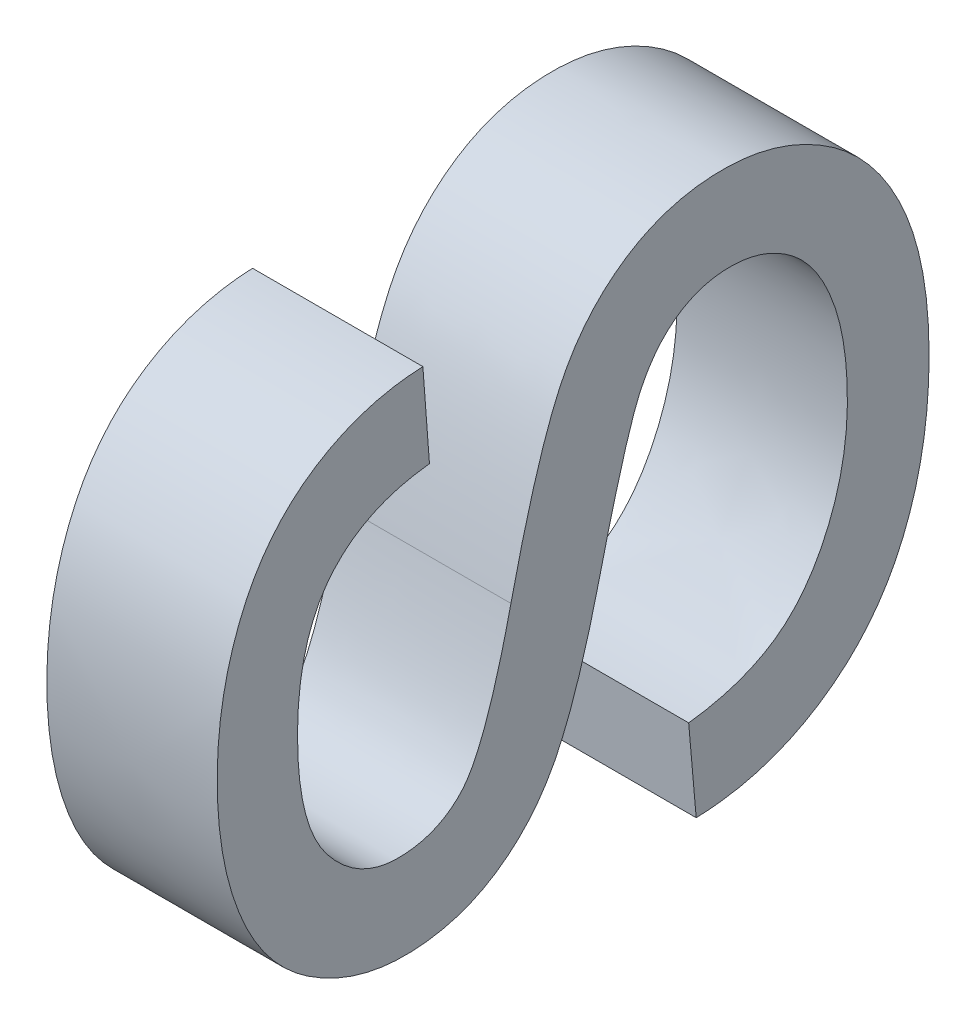
ISO-10303-21;
HEADER;
FILE_DESCRIPTION(('STEP AP214'),'2;1');
FILE_NAME('part.step','',(''),(''),'','','');
FILE_SCHEMA(('AUTOMOTIVE_DESIGN { 1 0 10303 214 1 1 1 1 }'));
ENDSEC;
DATA;
#1=APPLICATION_CONTEXT('core data for automotive mechanical design processes');
#2=APPLICATION_PROTOCOL_DEFINITION('international standard','automotive_design',2000,#1);
#3=PRODUCT_CONTEXT('',#1,'mechanical');
#4=PRODUCT('Part','Part','',(#3));
#5=PRODUCT_RELATED_PRODUCT_CATEGORY('part','',(#4));
#6=PRODUCT_DEFINITION_FORMATION('','',#4);
#7=PRODUCT_DEFINITION_CONTEXT('part definition',#1,'design');
#8=PRODUCT_DEFINITION('design','',#6,#7);
#9=PRODUCT_DEFINITION_SHAPE('','',#8);
#10=(LENGTH_UNIT() NAMED_UNIT(*) SI_UNIT(.MILLI.,.METRE.));
#11=(NAMED_UNIT(*) PLANE_ANGLE_UNIT() SI_UNIT($,.RADIAN.));
#12=(NAMED_UNIT(*) SI_UNIT($,.STERADIAN.) SOLID_ANGLE_UNIT());
#13=UNCERTAINTY_MEASURE_WITH_UNIT(LENGTH_MEASURE(1.E-05),#10,'distance_accuracy_value','');
#14=(GEOMETRIC_REPRESENTATION_CONTEXT(3) GLOBAL_UNCERTAINTY_ASSIGNED_CONTEXT((#13)) GLOBAL_UNIT_ASSIGNED_CONTEXT((#10,
#11,#12)) REPRESENTATION_CONTEXT('',''));
#15=CARTESIAN_POINT('',(0.,0.,0.));
#16=DIRECTION('',(0.,0.,1.));
#17=DIRECTION('',(1.,0.,0.));
#18=AXIS2_PLACEMENT_3D('',#15,#16,#17);
#19=CARTESIAN_POINT('',(4.55229940712933,-40.7604175531636,-9.25696894879945));
#20=DIRECTION('',(-1.,0.,0.));
#21=DIRECTION('',(0.,0.,1.));
#22=AXIS2_PLACEMENT_3D('',#19,#20,#21);
#23=PLANE('',#22);
#24=CARTESIAN_POINT('',(4.55229940712938,-41.1355313061002,-9.08233227842367));
#25=CARTESIAN_POINT('',(4.55229940712937,-41.1103090056195,-9.08012704996634));
#26=CARTESIAN_POINT('',(4.55229940712937,-41.0850867051389,-9.07792182150902));
#27=(BOUNDED_CURVE() B_SPLINE_CURVE(2,(#24,#25,#26),.UNSPECIFIED.,.F.,
.F.) B_SPLINE_CURVE_WITH_KNOTS((3,3),(50.,51.),
.UNSPECIFIED.) CURVE() GEOMETRIC_REPRESENTATION_ITEM() RATIONAL_B_SPLINE_CURVE((1.,1.,1.)) REPRESENTATION_ITEM(''));
#28=CARTESIAN_POINT('',(4.55229940712938,-41.1355313061002,-9.08233227842367));
#29=VERTEX_POINT('',#28);
#30=CARTESIAN_POINT('',(4.55229940712937,-41.0850867051389,-9.07792182150902));
#31=VERTEX_POINT('',#30);
#32=EDGE_CURVE('E20',#29,#31,#27,.T.);
#33=ORIENTED_EDGE('',*,*,#32,.T.);
#34=CARTESIAN_POINT('',(4.55229940712937,-41.0850867051389,-9.07792182150902));
#35=CARTESIAN_POINT('',(4.55229940712937,-41.0815032088957,-9.10824371279723));
#36=CARTESIAN_POINT('',(4.55229940712937,-41.055316120965,-9.14711086435757));
#37=CARTESIAN_POINT('',(4.55229940712936,-41.0001854095319,-9.17109272383097));
#38=CARTESIAN_POINT('',(4.55229940712935,-40.9351311700408,-9.17109272383097));
#39=CARTESIAN_POINT('',(4.55229940712934,-40.8882700653227,-9.15289958905805));
#40=CARTESIAN_POINT('',(4.55229940712934,-40.8653908200779,-9.12119942998401));
#41=CARTESIAN_POINT('',(4.55229940712934,-40.8653908200779,-9.08343489265233));
#42=CARTESIAN_POINT('',(4.55229940712934,-40.8874431046512,-9.05504257626428));
#43=CARTESIAN_POINT('',(4.55229940712935,-40.9290667917832,-9.03905466994868));
#44=CARTESIAN_POINT('',(4.55229940712935,-40.9847488103306,-9.02568547242615));
#45=(BOUNDED_CURVE() B_SPLINE_CURVE(2,(#34,#35,#36,#37,#38,#39,#40,#41,#42,#43,#44),
.UNSPECIFIED.,.F.,.F.) B_SPLINE_CURVE_WITH_KNOTS((3,1,1,1,1,1,1,1,1,3),(51.,52.,53.,54.,55.,56.,
57.,58.,59.,60.),
.UNSPECIFIED.) CURVE() GEOMETRIC_REPRESENTATION_ITEM() RATIONAL_B_SPLINE_CURVE((1.,1.,1.,1.,1.,
1.,1.,1.,1.,1.,1.)) REPRESENTATION_ITEM(''));
#46=CARTESIAN_POINT('',(4.55229940712935,-40.9847488103306,-9.02568547242615));
#47=VERTEX_POINT('',#46);
#48=EDGE_CURVE('E71',#31,#47,#45,.T.);
#49=ORIENTED_EDGE('',*,*,#48,.T.);
#50=CARTESIAN_POINT('',(4.55229940712935,-40.9847488103306,-9.02568547242615));
#51=CARTESIAN_POINT('',(4.55229940712936,-41.0404308288781,-9.01231627490362));
#52=CARTESIAN_POINT('',(4.55229940712937,-41.0917023905109,-8.9853022263014));
#53=CARTESIAN_POINT('',(4.55229940712937,-41.1200947068989,-8.94037069648342));
#54=CARTESIAN_POINT('',(4.55229940712937,-41.1200947068989,-8.88193214236432));
#55=CARTESIAN_POINT('',(4.55229940712936,-41.0853623586961,-8.82873100583137));
#56=CARTESIAN_POINT('',(4.55229940712935,-41.018654197862,-8.80116565011482));
#57=CARTESIAN_POINT('',(4.55229940712934,-40.9329259415835,-8.80116565011482));
#58=CARTESIAN_POINT('',(4.55229940712933,-40.8642882058493,-8.8301092736172));
#59=CARTESIAN_POINT('',(4.55229940712933,-40.8273506291891,-8.88634259927897));
#60=CARTESIAN_POINT('',(4.55229940712933,-40.8259723614033,-8.92190190815333));
#61=(BOUNDED_CURVE() B_SPLINE_CURVE(2,(#50,#51,#52,#53,#54,#55,#56,#57,#58,#59,#60),
.UNSPECIFIED.,.F.,.F.) B_SPLINE_CURVE_WITH_KNOTS((3,1,1,1,1,1,1,1,1,3),(60.,61.,62.,63.,64.,65.,
66.,67.,68.,69.),
.UNSPECIFIED.) CURVE() GEOMETRIC_REPRESENTATION_ITEM() RATIONAL_B_SPLINE_CURVE((1.,1.,1.,1.,1.,
1.,1.,1.,1.,1.,1.)) REPRESENTATION_ITEM(''));
#62=CARTESIAN_POINT('',(4.55229940712933,-40.8259723614033,-8.92190190815333));
#63=VERTEX_POINT('',#62);
#64=EDGE_CURVE('E107',#47,#63,#61,.T.);
#65=ORIENTED_EDGE('',*,*,#64,.T.);
#66=CARTESIAN_POINT('',(4.55229940712933,-40.8259723614033,-8.92190190815333));
#67=CARTESIAN_POINT('',(4.55229940712933,-40.8516081422197,-8.92383148305348));
#68=CARTESIAN_POINT('',(4.55229940712934,-40.877243923036,-8.92576105795363));
#69=(BOUNDED_CURVE() B_SPLINE_CURVE(2,(#66,#67,#68),.UNSPECIFIED.,.F.,
.F.) B_SPLINE_CURVE_WITH_KNOTS((3,3),(69.,70.),
.UNSPECIFIED.) CURVE() GEOMETRIC_REPRESENTATION_ITEM() RATIONAL_B_SPLINE_CURVE((1.,1.,1.)) REPRESENTATION_ITEM(''));
#70=CARTESIAN_POINT('',(4.55229940712934,-40.877243923036,-8.92576105795363));
#71=VERTEX_POINT('',#70);
#72=EDGE_CURVE('E113',#63,#71,#69,.T.);
#73=ORIENTED_EDGE('',*,*,#72,.T.);
#74=CARTESIAN_POINT('',(4.55229940712934,-40.877243923036,-8.92576105795363));
#75=CARTESIAN_POINT('',(4.55229940712934,-40.8813787263936,-8.88744521350763));
#76=CARTESIAN_POINT('',(4.55229940712934,-40.9290667917832,-8.84830240839012));
#77=CARTESIAN_POINT('',(4.55229940712936,-41.0241672690053,-8.84830240839013));
#78=CARTESIAN_POINT('',(4.55229940712936,-41.0685474917089,-8.88386171726448));
#79=CARTESIAN_POINT('',(4.55229940712936,-41.0685474917089,-8.93072282198262));
#80=CARTESIAN_POINT('',(4.55229940712936,-41.0373986397492,-8.9588394848135));
#81=CARTESIAN_POINT('',(4.55229940712935,-40.9722065734796,-8.97358695012186));
#82=(BOUNDED_CURVE() B_SPLINE_CURVE(2,(#74,#75,#76,#77,#78,#79,#80,#81),.UNSPECIFIED.,.F.,
.F.) B_SPLINE_CURVE_WITH_KNOTS((3,1,1,1,1,1,3),(70.,71.,72.,73.,74.,75.,76.),
.UNSPECIFIED.) CURVE() GEOMETRIC_REPRESENTATION_ITEM() RATIONAL_B_SPLINE_CURVE((1.,1.,1.,1.,1.,
1.,1.,1.)) REPRESENTATION_ITEM(''));
#83=CARTESIAN_POINT('',(4.55229940712935,-40.9722065734796,-8.97358695012186));
#84=VERTEX_POINT('',#83);
#85=EDGE_CURVE('E176',#71,#84,#82,.T.);
#86=ORIENTED_EDGE('',*,*,#85,.T.);
#87=CARTESIAN_POINT('',(4.55229940712935,-40.9722065734796,-8.97358695012186));
#88=CARTESIAN_POINT('',(4.55229940712934,-40.9070145072099,-8.98833441543022));
#89=CARTESIAN_POINT('',(4.55229940712934,-40.8474733725113,-9.0156241175896));
#90=CARTESIAN_POINT('',(4.55229940712933,-40.813843604888,-9.06551741143657));
#91=CARTESIAN_POINT('',(4.55229940712933,-40.813843604888,-9.13029599737047));
#92=CARTESIAN_POINT('',(4.55229940712934,-40.8507811815482,-9.18735628370374));
#93=CARTESIAN_POINT('',(4.55229940712935,-40.9199702243967,-9.21905644277778));
#94=CARTESIAN_POINT('',(4.55229940712936,-41.0181028907476,-9.21905644277778));
#95=CARTESIAN_POINT('',(4.55229940712937,-41.0922536976252,-9.18708063014657));
#96=CARTESIAN_POINT('',(4.55229940712938,-41.1344286918715,-9.12285335132701));
#97=CARTESIAN_POINT('',(4.55229940712938,-41.1355313061002,-9.08233227842367));
#98=(BOUNDED_CURVE() B_SPLINE_CURVE(2,(#87,#88,#89,#90,#91,#92,#93,#94,#95,#96,#97),
.UNSPECIFIED.,.F.,.F.) B_SPLINE_CURVE_WITH_KNOTS((3,1,1,1,1,1,1,1,1,3),(76.,77.,78.,79.,80.,81.,
82.,83.,84.,85.),
.UNSPECIFIED.) CURVE() GEOMETRIC_REPRESENTATION_ITEM() RATIONAL_B_SPLINE_CURVE((1.,1.,1.,1.,1.,
1.,1.,1.,1.,1.,1.)) REPRESENTATION_ITEM(''));
#99=EDGE_CURVE('E11',#84,#29,#98,.T.);
#100=ORIENTED_EDGE('',*,*,#99,.T.);
#101=EDGE_LOOP('',(#33,#49,#65,#73,#86,#100));
#102=FACE_BOUND('',#101,.T.);
#103=ADVANCED_FACE('F16',(#102),#23,.T.);
#104=CARTESIAN_POINT('',(4.65229940712933,-40.7604175531636,-9.25696894879945));
#105=DIRECTION('',(1.,0.,0.));
#106=DIRECTION('',(0.,1.,0.));
#107=AXIS2_PLACEMENT_3D('',#104,#105,#106);
#108=PLANE('',#107);
#109=CARTESIAN_POINT('',(4.65229940712935,-40.9722065734796,-8.97358695012186));
#110=CARTESIAN_POINT('',(4.65229940712934,-40.9070145072099,-8.98833441543022));
#111=CARTESIAN_POINT('',(4.65229940712934,-40.8474733725113,-9.0156241175896));
#112=CARTESIAN_POINT('',(4.65229940712933,-40.813843604888,-9.06551741143657));
#113=CARTESIAN_POINT('',(4.65229940712933,-40.813843604888,-9.13029599737047));
#114=CARTESIAN_POINT('',(4.65229940712934,-40.8507811815482,-9.18735628370374));
#115=CARTESIAN_POINT('',(4.65229940712935,-40.9199702243967,-9.21905644277778));
#116=CARTESIAN_POINT('',(4.65229940712937,-41.0181028907476,-9.21905644277778));
#117=CARTESIAN_POINT('',(4.65229940712937,-41.0922536976252,-9.18708063014658));
#118=CARTESIAN_POINT('',(4.65229940712938,-41.1344286918715,-9.12285335132701));
#119=CARTESIAN_POINT('',(4.65229940712938,-41.1355313061002,-9.08233227842368));
#120=(BOUNDED_CURVE() B_SPLINE_CURVE(2,(#109,#110,#111,#112,#113,#114,#115,#116,#117,#118,#119),
.UNSPECIFIED.,.F.,.F.) B_SPLINE_CURVE_WITH_KNOTS((3,1,1,1,1,1,1,1,1,3),(76.,77.,78.,79.,80.,81.,
82.,83.,84.,85.),
.UNSPECIFIED.) CURVE() GEOMETRIC_REPRESENTATION_ITEM() RATIONAL_B_SPLINE_CURVE((1.,1.,1.,1.,1.,
1.,1.,1.,1.,1.,1.)) REPRESENTATION_ITEM(''));
#121=CARTESIAN_POINT('',(4.65229940712935,-40.9722065734796,-8.97358695012186));
#122=VERTEX_POINT('',#121);
#123=CARTESIAN_POINT('',(4.65229940712938,-41.1355313061002,-9.08233227842368));
#124=VERTEX_POINT('',#123);
#125=EDGE_CURVE('E29',#122,#124,#120,.T.);
#126=ORIENTED_EDGE('',*,*,#125,.F.);
#127=CARTESIAN_POINT('',(4.65229940712934,-40.877243923036,-8.92576105795364));
#128=CARTESIAN_POINT('',(4.65229940712934,-40.8813787263935,-8.88744521350763));
#129=CARTESIAN_POINT('',(4.65229940712934,-40.9290667917832,-8.84830240839013));
#130=CARTESIAN_POINT('',(4.65229940712936,-41.0241672690053,-8.84830240839013));
#131=CARTESIAN_POINT('',(4.65229940712936,-41.0685474917089,-8.88386171726448));
#132=CARTESIAN_POINT('',(4.65229940712937,-41.0685474917089,-8.93072282198262));
#133=CARTESIAN_POINT('',(4.65229940712936,-41.0373986397492,-8.9588394848135));
#134=CARTESIAN_POINT('',(4.65229940712935,-40.9722065734796,-8.97358695012186));
#135=(BOUNDED_CURVE() B_SPLINE_CURVE(2,(#127,#128,#129,#130,#131,#132,#133,#134),.UNSPECIFIED.,
.F.,.F.) B_SPLINE_CURVE_WITH_KNOTS((3,1,1,1,1,1,3),(70.,71.,72.,73.,74.,75.,76.),
.UNSPECIFIED.) CURVE() GEOMETRIC_REPRESENTATION_ITEM() RATIONAL_B_SPLINE_CURVE((1.,1.,1.,1.,1.,
1.,1.,1.)) REPRESENTATION_ITEM(''));
#136=CARTESIAN_POINT('',(4.65229940712934,-40.877243923036,-8.92576105795364));
#137=VERTEX_POINT('',#136);
#138=EDGE_CURVE('E101',#137,#122,#135,.T.);
#139=ORIENTED_EDGE('',*,*,#138,.F.);
#140=CARTESIAN_POINT('',(4.65229940712933,-40.8259723614033,-8.92190190815333));
#141=CARTESIAN_POINT('',(4.65229940712933,-40.8516081422196,-8.92383148305349));
#142=CARTESIAN_POINT('',(4.65229940712934,-40.877243923036,-8.92576105795364));
#143=(BOUNDED_CURVE() B_SPLINE_CURVE(2,(#140,#141,#142),.UNSPECIFIED.,.F.,
.F.) B_SPLINE_CURVE_WITH_KNOTS((3,3),(69.,70.),
.UNSPECIFIED.) CURVE() GEOMETRIC_REPRESENTATION_ITEM() RATIONAL_B_SPLINE_CURVE((1.,1.,1.)) REPRESENTATION_ITEM(''));
#144=CARTESIAN_POINT('',(4.65229940712933,-40.8259723614033,-8.92190190815333));
#145=VERTEX_POINT('',#144);
#146=EDGE_CURVE('E95',#145,#137,#143,.T.);
#147=ORIENTED_EDGE('',*,*,#146,.F.);
#148=CARTESIAN_POINT('',(4.65229940712936,-40.9847488103306,-9.02568547242615));
#149=CARTESIAN_POINT('',(4.65229940712936,-41.0404308288781,-9.01231627490362));
#150=CARTESIAN_POINT('',(4.65229940712937,-41.0917023905108,-8.9853022263014));
#151=CARTESIAN_POINT('',(4.65229940712937,-41.1200947068989,-8.94037069648342));
#152=CARTESIAN_POINT('',(4.65229940712937,-41.1200947068989,-8.88193214236432));
#153=CARTESIAN_POINT('',(4.65229940712937,-41.085362358696,-8.82873100583138));
#154=CARTESIAN_POINT('',(4.65229940712936,-41.018654197862,-8.80116565011482));
#155=CARTESIAN_POINT('',(4.65229940712934,-40.9329259415835,-8.80116565011482));
#156=CARTESIAN_POINT('',(4.65229940712933,-40.8642882058493,-8.8301092736172));
#157=CARTESIAN_POINT('',(4.65229940712933,-40.8273506291891,-8.88634259927897));
#158=CARTESIAN_POINT('',(4.65229940712933,-40.8259723614033,-8.92190190815333));
#159=(BOUNDED_CURVE() B_SPLINE_CURVE(2,(#148,#149,#150,#151,#152,#153,#154,#155,#156,#157,#158),
.UNSPECIFIED.,.F.,.F.) B_SPLINE_CURVE_WITH_KNOTS((3,1,1,1,1,1,1,1,1,3),(60.,61.,62.,63.,64.,65.,
66.,67.,68.,69.),
.UNSPECIFIED.) CURVE() GEOMETRIC_REPRESENTATION_ITEM() RATIONAL_B_SPLINE_CURVE((1.,1.,1.,1.,1.,
1.,1.,1.,1.,1.,1.)) REPRESENTATION_ITEM(''));
#160=CARTESIAN_POINT('',(4.65229940712936,-40.9847488103306,-9.02568547242615));
#161=VERTEX_POINT('',#160);
#162=EDGE_CURVE('E98',#161,#145,#159,.T.);
#163=ORIENTED_EDGE('',*,*,#162,.F.);
#164=CARTESIAN_POINT('',(4.65229940712937,-41.0850867051389,-9.07792182150902));
#165=CARTESIAN_POINT('',(4.65229940712937,-41.0815032088957,-9.10824371279723));
#166=CARTESIAN_POINT('',(4.65229940712937,-41.055316120965,-9.14711086435757));
#167=CARTESIAN_POINT('',(4.65229940712936,-41.0001854095319,-9.17109272383097));
#168=CARTESIAN_POINT('',(4.65229940712935,-40.9351311700408,-9.17109272383097));
#169=CARTESIAN_POINT('',(4.65229940712935,-40.8882700653227,-9.15289958905805));
#170=CARTESIAN_POINT('',(4.65229940712934,-40.8653908200779,-9.12119942998401));
#171=CARTESIAN_POINT('',(4.65229940712934,-40.8653908200779,-9.08343489265233));
#172=CARTESIAN_POINT('',(4.65229940712934,-40.8874431046512,-9.05504257626428));
#173=CARTESIAN_POINT('',(4.65229940712935,-40.9290667917832,-9.03905466994868));
#174=CARTESIAN_POINT('',(4.65229940712936,-40.9847488103306,-9.02568547242615));
#175=(BOUNDED_CURVE() B_SPLINE_CURVE(2,(#164,#165,#166,#167,#168,#169,#170,#171,#172,#173,#174),
.UNSPECIFIED.,.F.,.F.) B_SPLINE_CURVE_WITH_KNOTS((3,1,1,1,1,1,1,1,1,3),(51.,52.,53.,54.,55.,56.,
57.,58.,59.,60.),
.UNSPECIFIED.) CURVE() GEOMETRIC_REPRESENTATION_ITEM() RATIONAL_B_SPLINE_CURVE((1.,1.,1.,1.,1.,
1.,1.,1.,1.,1.,1.)) REPRESENTATION_ITEM(''));
#176=CARTESIAN_POINT('',(4.65229940712937,-41.0850867051389,-9.07792182150902));
#177=VERTEX_POINT('',#176);
#178=EDGE_CURVE('E84',#177,#161,#175,.T.);
#179=ORIENTED_EDGE('',*,*,#178,.F.);
#180=CARTESIAN_POINT('',(4.65229940712938,-41.1355313061002,-9.08233227842368));
#181=CARTESIAN_POINT('',(4.65229940712937,-41.1103090056195,-9.08012704996634));
#182=CARTESIAN_POINT('',(4.65229940712937,-41.0850867051389,-9.07792182150902));
#183=(BOUNDED_CURVE() B_SPLINE_CURVE(2,(#180,#181,#182),.UNSPECIFIED.,.F.,
.F.) B_SPLINE_CURVE_WITH_KNOTS((3,3),(50.,51.),
.UNSPECIFIED.) CURVE() GEOMETRIC_REPRESENTATION_ITEM() RATIONAL_B_SPLINE_CURVE((1.,1.,1.)) REPRESENTATION_ITEM(''));
#184=EDGE_CURVE('E139',#124,#177,#183,.T.);
#185=ORIENTED_EDGE('',*,*,#184,.F.);
#186=EDGE_LOOP('',(#126,#139,#147,#163,#179,#185));
#187=FACE_BOUND('',#186,.T.);
#188=ADVANCED_FACE('F18',(#187),#108,.T.);
#189=CARTESIAN_POINT('',(4.65229940712935,-40.9722065734796,-8.97358695012186));
#190=CARTESIAN_POINT('',(4.55229940712935,-40.9722065734796,-8.97358695012186));
#191=CARTESIAN_POINT('',(4.65229940712934,-40.9070145072099,-8.98833441543022));
#192=CARTESIAN_POINT('',(4.55229940712934,-40.9070145072099,-8.98833441543022));
#193=CARTESIAN_POINT('',(4.65229940712934,-40.8474733725113,-9.0156241175896));
#194=CARTESIAN_POINT('',(4.55229940712934,-40.8474733725113,-9.0156241175896));
#195=CARTESIAN_POINT('',(4.65229940712933,-40.813843604888,-9.06551741143657));
#196=CARTESIAN_POINT('',(4.55229940712933,-40.813843604888,-9.06551741143657));
#197=CARTESIAN_POINT('',(4.65229940712933,-40.813843604888,-9.13029599737047));
#198=CARTESIAN_POINT('',(4.55229940712933,-40.813843604888,-9.13029599737047));
#199=CARTESIAN_POINT('',(4.65229940712934,-40.8507811815482,-9.18735628370374));
#200=CARTESIAN_POINT('',(4.55229940712934,-40.8507811815482,-9.18735628370374));
#201=CARTESIAN_POINT('',(4.65229940712935,-40.9199702243967,-9.21905644277778));
#202=CARTESIAN_POINT('',(4.55229940712935,-40.9199702243967,-9.21905644277778));
#203=CARTESIAN_POINT('',(4.65229940712937,-41.0181028907476,-9.21905644277778));
#204=CARTESIAN_POINT('',(4.55229940712936,-41.0181028907476,-9.21905644277778));
#205=CARTESIAN_POINT('',(4.65229940712937,-41.0922536976252,-9.18708063014658));
#206=CARTESIAN_POINT('',(4.55229940712937,-41.0922536976252,-9.18708063014657));
#207=CARTESIAN_POINT('',(4.65229940712938,-41.1344286918715,-9.12285335132701));
#208=CARTESIAN_POINT('',(4.55229940712938,-41.1344286918715,-9.12285335132701));
#209=CARTESIAN_POINT('',(4.65229940712938,-41.1355313061002,-9.08233227842368));
#210=CARTESIAN_POINT('',(4.55229940712938,-41.1355313061002,-9.08233227842367));
#211=(BOUNDED_SURFACE() B_SPLINE_SURFACE(2,1,((#189,#190),(#191,#192),(#193,#194),(#195,#196),
(#197,#198),(#199,#200),(#201,#202),(#203,#204),(#205,#206),(#207,#208),(#209,#210)),
.UNSPECIFIED.,.F.,.F.,.F.) B_SPLINE_SURFACE_WITH_KNOTS((3,1,1,1,1,1,1,1,1,3),(2,2),(76.,77.,78.,
79.,80.,81.,82.,83.,84.,85.),(0.,0.1),
.UNSPECIFIED.) GEOMETRIC_REPRESENTATION_ITEM() RATIONAL_B_SPLINE_SURFACE(((1.,1.),(1.,1.),(1.,
1.),(1.,1.),(1.,1.),(1.,1.),(1.,1.),(1.,1.),(1.,1.),(1.,1.),(1.,1.))) REPRESENTATION_ITEM('') SURFACE());
#212=CARTESIAN_POINT('',(4.65229940712938,-41.1355313061002,-9.08233227842368));
#213=CARTESIAN_POINT('',(4.55229940712938,-41.1355313061002,-9.08233227842367));
#214=(BOUNDED_CURVE() B_SPLINE_CURVE(1,(#212,#213),.UNSPECIFIED.,.F.,
.F.) B_SPLINE_CURVE_WITH_KNOTS((2,2),(0.,0.1),
.UNSPECIFIED.) CURVE() GEOMETRIC_REPRESENTATION_ITEM() RATIONAL_B_SPLINE_CURVE((1.,1.)) REPRESENTATION_ITEM(''));
#215=EDGE_CURVE('E153',#124,#29,#214,.T.);
#216=CARTESIAN_POINT('',(4.65229940712935,-40.9722065734796,-8.97358695012186));
#217=CARTESIAN_POINT('',(4.55229940712935,-40.9722065734796,-8.97358695012186));
#218=(BOUNDED_CURVE() B_SPLINE_CURVE(1,(#216,#217),.UNSPECIFIED.,.F.,
.F.) B_SPLINE_CURVE_WITH_KNOTS((2,2),(0.,0.1),
.UNSPECIFIED.) CURVE() GEOMETRIC_REPRESENTATION_ITEM() RATIONAL_B_SPLINE_CURVE((1.,1.)) REPRESENTATION_ITEM(''));
#219=EDGE_CURVE('E167',#122,#84,#218,.T.);
#220=ORIENTED_EDGE('',*,*,#125,.T.);
#221=ORIENTED_EDGE('',*,*,#215,.T.);
#222=ORIENTED_EDGE('',*,*,#99,.F.);
#223=ORIENTED_EDGE('',*,*,#219,.F.);
#224=EDGE_LOOP('',(#220,#221,#222,#223));
#225=FACE_BOUND('',#224,.T.);
#226=ADVANCED_FACE('F299',(#225),#211,.T.);
#227=CARTESIAN_POINT('',(4.65229940712934,-40.877243923036,-8.92576105795364));
#228=CARTESIAN_POINT('',(4.55229940712934,-40.877243923036,-8.92576105795363));
#229=CARTESIAN_POINT('',(4.65229940712934,-40.8813787263935,-8.88744521350763));
#230=CARTESIAN_POINT('',(4.55229940712934,-40.8813787263936,-8.88744521350763));
#231=CARTESIAN_POINT('',(4.65229940712934,-40.9290667917832,-8.84830240839013));
#232=CARTESIAN_POINT('',(4.55229940712934,-40.9290667917832,-8.84830240839012));
#233=CARTESIAN_POINT('',(4.65229940712936,-41.0241672690053,-8.84830240839013));
#234=CARTESIAN_POINT('',(4.55229940712936,-41.0241672690053,-8.84830240839013));
#235=CARTESIAN_POINT('',(4.65229940712936,-41.0685474917089,-8.88386171726448));
#236=CARTESIAN_POINT('',(4.55229940712936,-41.0685474917089,-8.88386171726448));
#237=CARTESIAN_POINT('',(4.65229940712937,-41.0685474917089,-8.93072282198262));
#238=CARTESIAN_POINT('',(4.55229940712936,-41.0685474917089,-8.93072282198262));
#239=CARTESIAN_POINT('',(4.65229940712936,-41.0373986397492,-8.9588394848135));
#240=CARTESIAN_POINT('',(4.55229940712936,-41.0373986397492,-8.9588394848135));
#241=CARTESIAN_POINT('',(4.65229940712935,-40.9722065734796,-8.97358695012186));
#242=CARTESIAN_POINT('',(4.55229940712935,-40.9722065734796,-8.97358695012186));
#243=(BOUNDED_SURFACE() B_SPLINE_SURFACE(2,1,((#227,#228),(#229,#230),(#231,#232),(#233,#234),
(#235,#236),(#237,#238),(#239,#240),(#241,#242)),.UNSPECIFIED.,.F.,.F.,
.F.) B_SPLINE_SURFACE_WITH_KNOTS((3,1,1,1,1,1,3),(2,2),(70.,71.,72.,73.,74.,75.,76.),(0.,0.1),
.UNSPECIFIED.) GEOMETRIC_REPRESENTATION_ITEM() RATIONAL_B_SPLINE_SURFACE(((1.,1.),(1.,1.),(1.,
1.),(1.,1.),(1.,1.),(1.,1.),(1.,1.),(1.,1.))) REPRESENTATION_ITEM('') SURFACE());
#244=CARTESIAN_POINT('',(4.65229940712934,-40.877243923036,-8.92576105795364));
#245=CARTESIAN_POINT('',(4.55229940712934,-40.877243923036,-8.92576105795363));
#246=(BOUNDED_CURVE() B_SPLINE_CURVE(1,(#244,#245),.UNSPECIFIED.,.F.,
.F.) B_SPLINE_CURVE_WITH_KNOTS((2,2),(0.,0.1),
.UNSPECIFIED.) CURVE() GEOMETRIC_REPRESENTATION_ITEM() RATIONAL_B_SPLINE_CURVE((1.,1.)) REPRESENTATION_ITEM(''));
#247=EDGE_CURVE('E106',#137,#71,#246,.T.);
#248=ORIENTED_EDGE('',*,*,#138,.T.);
#249=ORIENTED_EDGE('',*,*,#219,.T.);
#250=ORIENTED_EDGE('',*,*,#85,.F.);
#251=ORIENTED_EDGE('',*,*,#247,.F.);
#252=EDGE_LOOP('',(#248,#249,#250,#251));
#253=FACE_BOUND('',#252,.T.);
#254=ADVANCED_FACE('F244',(#253),#243,.T.);
#255=CARTESIAN_POINT('',(4.65229940712933,-40.8259723614033,-8.92190190815333));
#256=CARTESIAN_POINT('',(4.55229940712933,-40.8259723614033,-8.92190190815333));
#257=CARTESIAN_POINT('',(4.65229940712933,-40.8516081422196,-8.92383148305349));
#258=CARTESIAN_POINT('',(4.55229940712933,-40.8516081422197,-8.92383148305348));
#259=CARTESIAN_POINT('',(4.65229940712934,-40.877243923036,-8.92576105795364));
#260=CARTESIAN_POINT('',(4.55229940712934,-40.877243923036,-8.92576105795363));
#261=(BOUNDED_SURFACE() B_SPLINE_SURFACE(2,1,((#255,#256),(#257,#258),(#259,#260)),
.UNSPECIFIED.,.F.,.F.,.F.) B_SPLINE_SURFACE_WITH_KNOTS((3,3),(2,2),(69.,70.),(0.,0.1),
.UNSPECIFIED.) GEOMETRIC_REPRESENTATION_ITEM() RATIONAL_B_SPLINE_SURFACE(((1.,1.),(1.,1.),(1.,1.))) REPRESENTATION_ITEM('') SURFACE());
#262=CARTESIAN_POINT('',(4.65229940712933,-40.8259723614033,-8.92190190815333));
#263=CARTESIAN_POINT('',(4.55229940712933,-40.8259723614033,-8.92190190815333));
#264=(BOUNDED_CURVE() B_SPLINE_CURVE(1,(#262,#263),.UNSPECIFIED.,.F.,
.F.) B_SPLINE_CURVE_WITH_KNOTS((2,2),(0.,0.1),
.UNSPECIFIED.) CURVE() GEOMETRIC_REPRESENTATION_ITEM() RATIONAL_B_SPLINE_CURVE((1.,1.)) REPRESENTATION_ITEM(''));
#265=EDGE_CURVE('E110',#145,#63,#264,.T.);
#266=ORIENTED_EDGE('',*,*,#146,.T.);
#267=ORIENTED_EDGE('',*,*,#247,.T.);
#268=ORIENTED_EDGE('',*,*,#72,.F.);
#269=ORIENTED_EDGE('',*,*,#265,.F.);
#270=EDGE_LOOP('',(#266,#267,#268,#269));
#271=FACE_BOUND('',#270,.T.);
#272=ADVANCED_FACE('F111',(#271),#261,.T.);
#273=CARTESIAN_POINT('',(4.65229940712936,-40.9847488103306,-9.02568547242615));
#274=CARTESIAN_POINT('',(4.55229940712935,-40.9847488103306,-9.02568547242615));
#275=CARTESIAN_POINT('',(4.65229940712936,-41.0404308288781,-9.01231627490362));
#276=CARTESIAN_POINT('',(4.55229940712936,-41.0404308288781,-9.01231627490362));
#277=CARTESIAN_POINT('',(4.65229940712937,-41.0917023905108,-8.9853022263014));
#278=CARTESIAN_POINT('',(4.55229940712937,-41.0917023905109,-8.9853022263014));
#279=CARTESIAN_POINT('',(4.65229940712937,-41.1200947068989,-8.94037069648342));
#280=CARTESIAN_POINT('',(4.55229940712937,-41.1200947068989,-8.94037069648342));
#281=CARTESIAN_POINT('',(4.65229940712937,-41.1200947068989,-8.88193214236432));
#282=CARTESIAN_POINT('',(4.55229940712937,-41.1200947068989,-8.88193214236432));
#283=CARTESIAN_POINT('',(4.65229940712937,-41.085362358696,-8.82873100583138));
#284=CARTESIAN_POINT('',(4.55229940712936,-41.0853623586961,-8.82873100583137));
#285=CARTESIAN_POINT('',(4.65229940712936,-41.018654197862,-8.80116565011482));
#286=CARTESIAN_POINT('',(4.55229940712935,-41.018654197862,-8.80116565011482));
#287=CARTESIAN_POINT('',(4.65229940712934,-40.9329259415835,-8.80116565011482));
#288=CARTESIAN_POINT('',(4.55229940712934,-40.9329259415835,-8.80116565011482));
#289=CARTESIAN_POINT('',(4.65229940712933,-40.8642882058493,-8.8301092736172));
#290=CARTESIAN_POINT('',(4.55229940712933,-40.8642882058493,-8.8301092736172));
#291=CARTESIAN_POINT('',(4.65229940712933,-40.8273506291891,-8.88634259927897));
#292=CARTESIAN_POINT('',(4.55229940712933,-40.8273506291891,-8.88634259927897));
#293=CARTESIAN_POINT('',(4.65229940712933,-40.8259723614033,-8.92190190815333));
#294=CARTESIAN_POINT('',(4.55229940712933,-40.8259723614033,-8.92190190815333));
#295=(BOUNDED_SURFACE() B_SPLINE_SURFACE(2,1,((#273,#274),(#275,#276),(#277,#278),(#279,#280),
(#281,#282),(#283,#284),(#285,#286),(#287,#288),(#289,#290),(#291,#292),(#293,#294)),
.UNSPECIFIED.,.F.,.F.,.F.) B_SPLINE_SURFACE_WITH_KNOTS((3,1,1,1,1,1,1,1,1,3),(2,2),(60.,61.,62.,
63.,64.,65.,66.,67.,68.,69.),(0.,0.1),
.UNSPECIFIED.) GEOMETRIC_REPRESENTATION_ITEM() RATIONAL_B_SPLINE_SURFACE(((1.,1.),(1.,1.),(1.,
1.),(1.,1.),(1.,1.),(1.,1.),(1.,1.),(1.,1.),(1.,1.),(1.,1.),(1.,1.))) REPRESENTATION_ITEM('') SURFACE());
#296=CARTESIAN_POINT('',(4.65229940712936,-40.9847488103306,-9.02568547242615));
#297=CARTESIAN_POINT('',(4.55229940712935,-40.9847488103306,-9.02568547242615));
#298=(BOUNDED_CURVE() B_SPLINE_CURVE(1,(#296,#297),.UNSPECIFIED.,.F.,
.F.) B_SPLINE_CURVE_WITH_KNOTS((2,2),(0.,0.1),
.UNSPECIFIED.) CURVE() GEOMETRIC_REPRESENTATION_ITEM() RATIONAL_B_SPLINE_CURVE((1.,1.)) REPRESENTATION_ITEM(''));
#299=EDGE_CURVE('E119',#161,#47,#298,.T.);
#300=ORIENTED_EDGE('',*,*,#162,.T.);
#301=ORIENTED_EDGE('',*,*,#265,.T.);
#302=ORIENTED_EDGE('',*,*,#64,.F.);
#303=ORIENTED_EDGE('',*,*,#299,.F.);
#304=EDGE_LOOP('',(#300,#301,#302,#303));
#305=FACE_BOUND('',#304,.T.);
#306=ADVANCED_FACE('F118',(#305),#295,.T.);
#307=CARTESIAN_POINT('',(4.65229940712937,-41.0850867051389,-9.07792182150902));
#308=CARTESIAN_POINT('',(4.55229940712937,-41.0850867051389,-9.07792182150902));
#309=CARTESIAN_POINT('',(4.65229940712937,-41.0815032088957,-9.10824371279723));
#310=CARTESIAN_POINT('',(4.55229940712937,-41.0815032088957,-9.10824371279723));
#311=CARTESIAN_POINT('',(4.65229940712937,-41.055316120965,-9.14711086435757));
#312=CARTESIAN_POINT('',(4.55229940712937,-41.055316120965,-9.14711086435757));
#313=CARTESIAN_POINT('',(4.65229940712936,-41.0001854095319,-9.17109272383097));
#314=CARTESIAN_POINT('',(4.55229940712936,-41.0001854095319,-9.17109272383097));
#315=CARTESIAN_POINT('',(4.65229940712935,-40.9351311700408,-9.17109272383097));
#316=CARTESIAN_POINT('',(4.55229940712935,-40.9351311700408,-9.17109272383097));
#317=CARTESIAN_POINT('',(4.65229940712935,-40.8882700653227,-9.15289958905805));
#318=CARTESIAN_POINT('',(4.55229940712934,-40.8882700653227,-9.15289958905805));
#319=CARTESIAN_POINT('',(4.65229940712934,-40.8653908200779,-9.12119942998401));
#320=CARTESIAN_POINT('',(4.55229940712934,-40.8653908200779,-9.12119942998401));
#321=CARTESIAN_POINT('',(4.65229940712934,-40.8653908200779,-9.08343489265233));
#322=CARTESIAN_POINT('',(4.55229940712934,-40.8653908200779,-9.08343489265233));
#323=CARTESIAN_POINT('',(4.65229940712934,-40.8874431046512,-9.05504257626428));
#324=CARTESIAN_POINT('',(4.55229940712934,-40.8874431046512,-9.05504257626428));
#325=CARTESIAN_POINT('',(4.65229940712935,-40.9290667917832,-9.03905466994868));
#326=CARTESIAN_POINT('',(4.55229940712935,-40.9290667917832,-9.03905466994868));
#327=CARTESIAN_POINT('',(4.65229940712936,-40.9847488103306,-9.02568547242615));
#328=CARTESIAN_POINT('',(4.55229940712935,-40.9847488103306,-9.02568547242615));
#329=(BOUNDED_SURFACE() B_SPLINE_SURFACE(2,1,((#307,#308),(#309,#310),(#311,#312),(#313,#314),
(#315,#316),(#317,#318),(#319,#320),(#321,#322),(#323,#324),(#325,#326),(#327,#328)),
.UNSPECIFIED.,.F.,.F.,.F.) B_SPLINE_SURFACE_WITH_KNOTS((3,1,1,1,1,1,1,1,1,3),(2,2),(51.,52.,53.,
54.,55.,56.,57.,58.,59.,60.),(0.,0.1),
.UNSPECIFIED.) GEOMETRIC_REPRESENTATION_ITEM() RATIONAL_B_SPLINE_SURFACE(((1.,1.),(1.,1.),(1.,
1.),(1.,1.),(1.,1.),(1.,1.),(1.,1.),(1.,1.),(1.,1.),(1.,1.),(1.,1.))) REPRESENTATION_ITEM('') SURFACE());
#330=CARTESIAN_POINT('',(4.65229940712937,-41.0850867051389,-9.07792182150902));
#331=CARTESIAN_POINT('',(4.55229940712937,-41.0850867051389,-9.07792182150902));
#332=(BOUNDED_CURVE() B_SPLINE_CURVE(1,(#330,#331),.UNSPECIFIED.,.F.,
.F.) B_SPLINE_CURVE_WITH_KNOTS((2,2),(0.,0.1),
.UNSPECIFIED.) CURVE() GEOMETRIC_REPRESENTATION_ITEM() RATIONAL_B_SPLINE_CURVE((1.,1.)) REPRESENTATION_ITEM(''));
#333=EDGE_CURVE('E131',#177,#31,#332,.T.);
#334=ORIENTED_EDGE('',*,*,#178,.T.);
#335=ORIENTED_EDGE('',*,*,#299,.T.);
#336=ORIENTED_EDGE('',*,*,#48,.F.);
#337=ORIENTED_EDGE('',*,*,#333,.F.);
#338=EDGE_LOOP('',(#334,#335,#336,#337));
#339=FACE_BOUND('',#338,.T.);
#340=ADVANCED_FACE('F251',(#339),#329,.T.);
#341=CARTESIAN_POINT('',(4.65229940712938,-41.1355313061002,-9.08233227842368));
#342=CARTESIAN_POINT('',(4.55229940712938,-41.1355313061002,-9.08233227842367));
#343=CARTESIAN_POINT('',(4.65229940712937,-41.1103090056195,-9.08012704996634));
#344=CARTESIAN_POINT('',(4.55229940712937,-41.1103090056195,-9.08012704996634));
#345=CARTESIAN_POINT('',(4.65229940712937,-41.0850867051389,-9.07792182150902));
#346=CARTESIAN_POINT('',(4.55229940712937,-41.0850867051389,-9.07792182150902));
#347=(BOUNDED_SURFACE() B_SPLINE_SURFACE(2,1,((#341,#342),(#343,#344),(#345,#346)),
.UNSPECIFIED.,.F.,.F.,.F.) B_SPLINE_SURFACE_WITH_KNOTS((3,3),(2,2),(50.,51.),(0.,0.1),
.UNSPECIFIED.) GEOMETRIC_REPRESENTATION_ITEM() RATIONAL_B_SPLINE_SURFACE(((1.,1.),(1.,1.),(1.,1.))) REPRESENTATION_ITEM('') SURFACE());
#348=ORIENTED_EDGE('',*,*,#184,.T.);
#349=ORIENTED_EDGE('',*,*,#333,.T.);
#350=ORIENTED_EDGE('',*,*,#32,.F.);
#351=ORIENTED_EDGE('',*,*,#215,.F.);
#352=EDGE_LOOP('',(#348,#349,#350,#351));
#353=FACE_BOUND('',#352,.T.);
#354=ADVANCED_FACE('F298',(#353),#347,.T.);
#355=CLOSED_SHELL('',(#103,#188,#226,#254,#272,#306,#340,#354));
#356=MANIFOLD_SOLID_BREP('B1',#355);
#357=ADVANCED_BREP_SHAPE_REPRESENTATION('',(#18,#356),#14);
#358=SHAPE_DEFINITION_REPRESENTATION(#9,#357);
ENDSEC;
END-ISO-10303-21;
